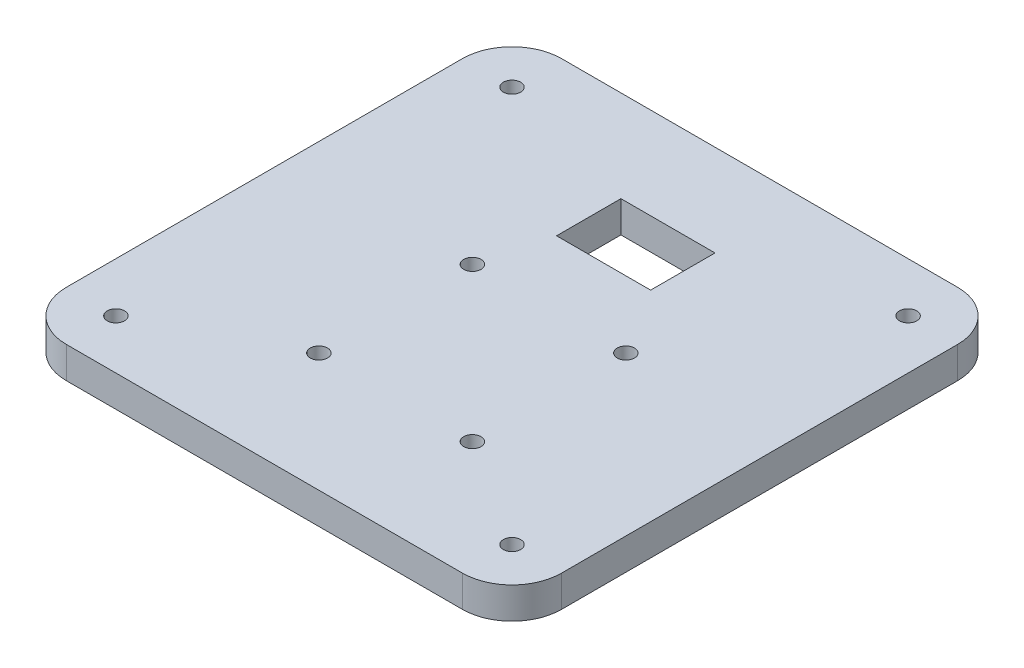
ISO-10303-21;
HEADER;
FILE_DESCRIPTION(('STEP AP214'),'2;1');
FILE_NAME('part.step','',(''),(''),'','','');
FILE_SCHEMA(('AUTOMOTIVE_DESIGN { 1 0 10303 214 1 1 1 1 }'));
ENDSEC;
DATA;
#1=APPLICATION_CONTEXT('core data for automotive mechanical design processes');
#2=APPLICATION_PROTOCOL_DEFINITION('international standard','automotive_design',2000,#1);
#3=PRODUCT_CONTEXT('',#1,'mechanical');
#4=PRODUCT('Part','Part','',(#3));
#5=PRODUCT_RELATED_PRODUCT_CATEGORY('part','',(#4));
#6=PRODUCT_DEFINITION_FORMATION('','',#4);
#7=PRODUCT_DEFINITION_CONTEXT('part definition',#1,'design');
#8=PRODUCT_DEFINITION('design','',#6,#7);
#9=PRODUCT_DEFINITION_SHAPE('','',#8);
#10=(LENGTH_UNIT() NAMED_UNIT(*) SI_UNIT(.MILLI.,.METRE.));
#11=(NAMED_UNIT(*) PLANE_ANGLE_UNIT() SI_UNIT($,.RADIAN.));
#12=(NAMED_UNIT(*) SI_UNIT($,.STERADIAN.) SOLID_ANGLE_UNIT());
#13=UNCERTAINTY_MEASURE_WITH_UNIT(LENGTH_MEASURE(1.E-05),#10,'distance_accuracy_value','');
#14=(GEOMETRIC_REPRESENTATION_CONTEXT(3) GLOBAL_UNCERTAINTY_ASSIGNED_CONTEXT((#13)) GLOBAL_UNIT_ASSIGNED_CONTEXT((#10,
#11,#12)) REPRESENTATION_CONTEXT('',''));
#15=CARTESIAN_POINT('',(0.,0.,0.));
#16=DIRECTION('',(0.,0.,1.));
#17=DIRECTION('',(1.,0.,0.));
#18=AXIS2_PLACEMENT_3D('',#15,#16,#17);
#19=CARTESIAN_POINT('',(-50.,6.35,-50.));
#20=DIRECTION('',(0.,0.,-1.));
#21=DIRECTION('',(-1.,0.,0.));
#22=AXIS2_PLACEMENT_3D('',#19,#20,#21);
#23=PLANE('',#22);
#24=DIRECTION('',(1.,0.,0.));
#25=VECTOR('',#24,1.);
#26=CARTESIAN_POINT('',(-50.,6.35,-50.));
#27=LINE('',#26,#25);
#28=CARTESIAN_POINT('',(-40.,6.35,-50.));
#29=VERTEX_POINT('',#28);
#30=CARTESIAN_POINT('',(40.,6.35,-50.));
#31=VERTEX_POINT('',#30);
#32=EDGE_CURVE('E220',#29,#31,#27,.T.);
#33=ORIENTED_EDGE('',*,*,#32,.T.);
#34=DIRECTION('',(0.,-1.,0.));
#35=VECTOR('',#34,1.);
#36=CARTESIAN_POINT('',(40.,6.35,-50.));
#37=LINE('',#36,#35);
#38=CARTESIAN_POINT('',(40.,0.,-50.));
#39=VERTEX_POINT('',#38);
#40=EDGE_CURVE('E11',#31,#39,#37,.T.);
#41=ORIENTED_EDGE('',*,*,#40,.T.);
#42=DIRECTION('',(1.,0.,0.));
#43=VECTOR('',#42,1.);
#44=CARTESIAN_POINT('',(-50.,0.,-50.));
#45=LINE('',#44,#43);
#46=CARTESIAN_POINT('',(-40.,0.,-50.));
#47=VERTEX_POINT('',#46);
#48=EDGE_CURVE('E217',#47,#39,#45,.T.);
#49=ORIENTED_EDGE('',*,*,#48,.F.);
#50=DIRECTION('',(0.,-1.,0.));
#51=VECTOR('',#50,1.);
#52=CARTESIAN_POINT('',(-40.,6.35,-50.));
#53=LINE('',#52,#51);
#54=EDGE_CURVE('E45',#47,#29,#53,.F.);
#55=ORIENTED_EDGE('',*,*,#54,.T.);
#56=EDGE_LOOP('',(#33,#41,#49,#55));
#57=FACE_BOUND('',#56,.T.);
#58=ADVANCED_FACE('F37',(#57),#23,.T.);
#59=CARTESIAN_POINT('',(-50.,6.35,-50.));
#60=DIRECTION('',(1.,0.,0.));
#61=DIRECTION('',(0.,0.,-1.));
#62=AXIS2_PLACEMENT_3D('',#59,#60,#61);
#63=PLANE('',#62);
#64=DIRECTION('',(0.,0.,1.));
#65=VECTOR('',#64,1.);
#66=CARTESIAN_POINT('',(-50.,0.,-50.));
#67=LINE('',#66,#65);
#68=CARTESIAN_POINT('',(-50.,0.,-40.));
#69=VERTEX_POINT('',#68);
#70=CARTESIAN_POINT('',(-50.,0.,40.));
#71=VERTEX_POINT('',#70);
#72=EDGE_CURVE('E224',#69,#71,#67,.T.);
#73=ORIENTED_EDGE('',*,*,#72,.T.);
#74=DIRECTION('',(0.,-1.,0.));
#75=VECTOR('',#74,1.);
#76=CARTESIAN_POINT('',(-50.,6.35,40.));
#77=LINE('',#76,#75);
#78=CARTESIAN_POINT('',(-50.,6.35,40.));
#79=VERTEX_POINT('',#78);
#80=EDGE_CURVE('E257',#71,#79,#77,.F.);
#81=ORIENTED_EDGE('',*,*,#80,.T.);
#82=DIRECTION('',(0.,0.,1.));
#83=VECTOR('',#82,1.);
#84=CARTESIAN_POINT('',(-50.,6.35,-50.));
#85=LINE('',#84,#83);
#86=CARTESIAN_POINT('',(-50.,6.35,-40.));
#87=VERTEX_POINT('',#86);
#88=EDGE_CURVE('E228',#87,#79,#85,.T.);
#89=ORIENTED_EDGE('',*,*,#88,.F.);
#90=DIRECTION('',(0.,-1.,0.));
#91=VECTOR('',#90,1.);
#92=CARTESIAN_POINT('',(-50.,0.,-40.));
#93=LINE('',#92,#91);
#94=EDGE_CURVE('E254',#87,#69,#93,.T.);
#95=ORIENTED_EDGE('',*,*,#94,.T.);
#96=EDGE_LOOP('',(#73,#81,#89,#95));
#97=FACE_BOUND('',#96,.T.);
#98=ADVANCED_FACE('F281',(#97),#63,.F.);
#99=CARTESIAN_POINT('',(-50.,6.35,50.));
#100=DIRECTION('',(0.,0.,-1.));
#101=DIRECTION('',(-1.,0.,0.));
#102=AXIS2_PLACEMENT_3D('',#99,#100,#101);
#103=PLANE('',#102);
#104=DIRECTION('',(1.,0.,0.));
#105=VECTOR('',#104,1.);
#106=CARTESIAN_POINT('',(-50.,6.35,50.));
#107=LINE('',#106,#105);
#108=CARTESIAN_POINT('',(-40.,6.35,50.));
#109=VERTEX_POINT('',#108);
#110=CARTESIAN_POINT('',(40.,6.35,50.));
#111=VERTEX_POINT('',#110);
#112=EDGE_CURVE('E226',#109,#111,#107,.T.);
#113=ORIENTED_EDGE('',*,*,#112,.F.);
#114=DIRECTION('',(0.,-1.,0.));
#115=VECTOR('',#114,1.);
#116=CARTESIAN_POINT('',(-40.,6.35,50.));
#117=LINE('',#116,#115);
#118=CARTESIAN_POINT('',(-40.,0.,50.));
#119=VERTEX_POINT('',#118);
#120=EDGE_CURVE('E243',#109,#119,#117,.T.);
#121=ORIENTED_EDGE('',*,*,#120,.T.);
#122=DIRECTION('',(1.,0.,0.));
#123=VECTOR('',#122,1.);
#124=CARTESIAN_POINT('',(-50.,0.,50.));
#125=LINE('',#124,#123);
#126=CARTESIAN_POINT('',(40.,0.,50.));
#127=VERTEX_POINT('',#126);
#128=EDGE_CURVE('E237',#119,#127,#125,.T.);
#129=ORIENTED_EDGE('',*,*,#128,.T.);
#130=DIRECTION('',(0.,-1.,0.));
#131=VECTOR('',#130,1.);
#132=CARTESIAN_POINT('',(40.,6.35,50.));
#133=LINE('',#132,#131);
#134=EDGE_CURVE('E231',#127,#111,#133,.F.);
#135=ORIENTED_EDGE('',*,*,#134,.T.);
#136=EDGE_LOOP('',(#113,#121,#129,#135));
#137=FACE_BOUND('',#136,.T.);
#138=ADVANCED_FACE('F292',(#137),#103,.F.);
#139=CARTESIAN_POINT('',(50.,6.35,-50.));
#140=DIRECTION('',(1.,0.,0.));
#141=DIRECTION('',(0.,0.,-1.));
#142=AXIS2_PLACEMENT_3D('',#139,#140,#141);
#143=PLANE('',#142);
#144=DIRECTION('',(0.,0.,1.));
#145=VECTOR('',#144,1.);
#146=CARTESIAN_POINT('',(50.,6.35,-50.));
#147=LINE('',#146,#145);
#148=CARTESIAN_POINT('',(50.,6.35,-40.));
#149=VERTEX_POINT('',#148);
#150=CARTESIAN_POINT('',(50.,6.35,40.));
#151=VERTEX_POINT('',#150);
#152=EDGE_CURVE('E223',#149,#151,#147,.T.);
#153=ORIENTED_EDGE('',*,*,#152,.T.);
#154=DIRECTION('',(0.,-1.,0.));
#155=VECTOR('',#154,1.);
#156=CARTESIAN_POINT('',(50.,0.,40.));
#157=LINE('',#156,#155);
#158=CARTESIAN_POINT('',(50.,0.,40.));
#159=VERTEX_POINT('',#158);
#160=EDGE_CURVE('E267',#151,#159,#157,.T.);
#161=ORIENTED_EDGE('',*,*,#160,.T.);
#162=DIRECTION('',(0.,0.,1.));
#163=VECTOR('',#162,1.);
#164=CARTESIAN_POINT('',(50.,0.,-50.));
#165=LINE('',#164,#163);
#166=CARTESIAN_POINT('',(50.,0.,-40.));
#167=VERTEX_POINT('',#166);
#168=EDGE_CURVE('E234',#167,#159,#165,.T.);
#169=ORIENTED_EDGE('',*,*,#168,.F.);
#170=DIRECTION('',(0.,-1.,0.));
#171=VECTOR('',#170,1.);
#172=CARTESIAN_POINT('',(50.,6.35,-40.));
#173=LINE('',#172,#171);
#174=EDGE_CURVE('E59',#167,#149,#173,.F.);
#175=ORIENTED_EDGE('',*,*,#174,.T.);
#176=EDGE_LOOP('',(#153,#161,#169,#175));
#177=FACE_BOUND('',#176,.T.);
#178=ADVANCED_FACE('F297',(#177),#143,.T.);
#179=CARTESIAN_POINT('',(0.,6.35,0.));
#180=DIRECTION('',(0.,-1.,0.));
#181=DIRECTION('',(0.,0.,-1.));
#182=AXIS2_PLACEMENT_3D('',#179,#180,#181);
#183=PLANE('',#182);
#184=DIRECTION('',(1.,0.,0.));
#185=VECTOR('',#184,1.);
#186=CARTESIAN_POINT('',(-9.49999999999999,6.35,-31.5));
#187=LINE('',#186,#185);
#188=CARTESIAN_POINT('',(-9.49999999999999,6.35,-31.5));
#189=VERTEX_POINT('',#188);
#190=CARTESIAN_POINT('',(9.50000000000001,6.35,-31.5));
#191=VERTEX_POINT('',#190);
#192=EDGE_CURVE('E140',#189,#191,#187,.T.);
#193=ORIENTED_EDGE('',*,*,#192,.T.);
#194=DIRECTION('',(0.,0.,1.));
#195=VECTOR('',#194,1.);
#196=CARTESIAN_POINT('',(9.50000000000001,6.35,-31.5));
#197=LINE('',#196,#195);
#198=CARTESIAN_POINT('',(9.50000000000001,6.35,-18.5));
#199=VERTEX_POINT('',#198);
#200=EDGE_CURVE('E132',#191,#199,#197,.T.);
#201=ORIENTED_EDGE('',*,*,#200,.T.);
#202=DIRECTION('',(-1.,0.,0.));
#203=VECTOR('',#202,1.);
#204=CARTESIAN_POINT('',(-9.49999999999999,6.35,-18.5));
#205=LINE('',#204,#203);
#206=CARTESIAN_POINT('',(-9.49999999999999,6.35,-18.5));
#207=VERTEX_POINT('',#206);
#208=EDGE_CURVE('E144',#199,#207,#205,.T.);
#209=ORIENTED_EDGE('',*,*,#208,.T.);
#210=DIRECTION('',(0.,0.,-1.));
#211=VECTOR('',#210,1.);
#212=CARTESIAN_POINT('',(-9.49999999999999,6.35,-31.5));
#213=LINE('',#212,#211);
#214=EDGE_CURVE('E148',#207,#189,#213,.T.);
#215=ORIENTED_EDGE('',*,*,#214,.T.);
#216=EDGE_LOOP('',(#193,#201,#209,#215));
#217=FACE_BOUND('',#216,.T.);
#218=CARTESIAN_POINT('',(-13.,6.35,26.));
#219=DIRECTION('',(0.,-1.,0.));
#220=DIRECTION('',(0.,0.,-1.));
#221=AXIS2_PLACEMENT_3D('',#218,#219,#220);
#222=CIRCLE('',#221,1.75);
#223=CARTESIAN_POINT('',(-13.,6.35,24.25));
#224=VERTEX_POINT('',#223);
#225=EDGE_CURVE('E172',#224,#224,#222,.T.);
#226=ORIENTED_EDGE('',*,*,#225,.T.);
#227=EDGE_LOOP('',(#226));
#228=FACE_BOUND('',#227,.T.);
#229=CARTESIAN_POINT('',(-13.,6.35,-5.));
#230=DIRECTION('',(0.,-1.,0.));
#231=DIRECTION('',(0.,0.,-1.));
#232=AXIS2_PLACEMENT_3D('',#229,#230,#231);
#233=CIRCLE('',#232,1.75);
#234=CARTESIAN_POINT('',(-13.,6.35,-6.75));
#235=VERTEX_POINT('',#234);
#236=EDGE_CURVE('E178',#235,#235,#233,.T.);
#237=ORIENTED_EDGE('',*,*,#236,.T.);
#238=EDGE_LOOP('',(#237));
#239=FACE_BOUND('',#238,.T.);
#240=CARTESIAN_POINT('',(18.,6.35,26.));
#241=DIRECTION('',(0.,-1.,0.));
#242=DIRECTION('',(0.,0.,-1.));
#243=AXIS2_PLACEMENT_3D('',#240,#241,#242);
#244=CIRCLE('',#243,1.75);
#245=CARTESIAN_POINT('',(18.,6.35,24.25));
#246=VERTEX_POINT('',#245);
#247=EDGE_CURVE('E184',#246,#246,#244,.T.);
#248=ORIENTED_EDGE('',*,*,#247,.T.);
#249=EDGE_LOOP('',(#248));
#250=FACE_BOUND('',#249,.T.);
#251=CARTESIAN_POINT('',(18.,6.35,-5.));
#252=DIRECTION('',(0.,-1.,0.));
#253=DIRECTION('',(0.,0.,-1.));
#254=AXIS2_PLACEMENT_3D('',#251,#252,#253);
#255=CIRCLE('',#254,1.75);
#256=CARTESIAN_POINT('',(18.,6.35,-6.75));
#257=VERTEX_POINT('',#256);
#258=EDGE_CURVE('E190',#257,#257,#255,.T.);
#259=ORIENTED_EDGE('',*,*,#258,.T.);
#260=EDGE_LOOP('',(#259));
#261=FACE_BOUND('',#260,.T.);
#262=CARTESIAN_POINT('',(40.,6.35,40.));
#263=DIRECTION('',(0.,-1.,0.));
#264=DIRECTION('',(0.,0.,-1.));
#265=AXIS2_PLACEMENT_3D('',#262,#263,#264);
#266=CIRCLE('',#265,1.75);
#267=CARTESIAN_POINT('',(40.,6.35,38.25));
#268=VERTEX_POINT('',#267);
#269=EDGE_CURVE('E196',#268,#268,#266,.T.);
#270=ORIENTED_EDGE('',*,*,#269,.T.);
#271=EDGE_LOOP('',(#270));
#272=FACE_BOUND('',#271,.T.);
#273=CARTESIAN_POINT('',(40.,6.35,-40.));
#274=DIRECTION('',(0.,-1.,0.));
#275=DIRECTION('',(0.,0.,-1.));
#276=AXIS2_PLACEMENT_3D('',#273,#274,#275);
#277=CIRCLE('',#276,1.75);
#278=CARTESIAN_POINT('',(40.,6.35,-41.75));
#279=VERTEX_POINT('',#278);
#280=EDGE_CURVE('E202',#279,#279,#277,.T.);
#281=ORIENTED_EDGE('',*,*,#280,.T.);
#282=EDGE_LOOP('',(#281));
#283=FACE_BOUND('',#282,.T.);
#284=CARTESIAN_POINT('',(-40.,6.35,40.));
#285=DIRECTION('',(0.,-1.,0.));
#286=DIRECTION('',(0.,0.,-1.));
#287=AXIS2_PLACEMENT_3D('',#284,#285,#286);
#288=CIRCLE('',#287,1.75);
#289=CARTESIAN_POINT('',(-40.,6.35,38.25));
#290=VERTEX_POINT('',#289);
#291=EDGE_CURVE('E208',#290,#290,#288,.T.);
#292=ORIENTED_EDGE('',*,*,#291,.T.);
#293=EDGE_LOOP('',(#292));
#294=FACE_BOUND('',#293,.T.);
#295=CARTESIAN_POINT('',(-40.,6.35,-40.));
#296=DIRECTION('',(0.,-1.,0.));
#297=DIRECTION('',(0.,0.,-1.));
#298=AXIS2_PLACEMENT_3D('',#295,#296,#297);
#299=CIRCLE('',#298,1.75);
#300=CARTESIAN_POINT('',(-40.,6.35,-41.75));
#301=VERTEX_POINT('',#300);
#302=EDGE_CURVE('E214',#301,#301,#299,.T.);
#303=ORIENTED_EDGE('',*,*,#302,.T.);
#304=EDGE_LOOP('',(#303));
#305=FACE_BOUND('',#304,.T.);
#306=ORIENTED_EDGE('',*,*,#88,.T.);
#307=CARTESIAN_POINT('',(-40.,6.35,40.));
#308=DIRECTION('',(0.,-1.,0.));
#309=DIRECTION('',(0.,0.,-1.));
#310=AXIS2_PLACEMENT_3D('',#307,#308,#309);
#311=CIRCLE('',#310,10.);
#312=EDGE_CURVE('E264',#79,#109,#311,.F.);
#313=ORIENTED_EDGE('',*,*,#312,.T.);
#314=ORIENTED_EDGE('',*,*,#112,.T.);
#315=CARTESIAN_POINT('',(40.,6.35,40.));
#316=DIRECTION('',(0.,-1.,0.));
#317=DIRECTION('',(0.,0.,-1.));
#318=AXIS2_PLACEMENT_3D('',#315,#316,#317);
#319=CIRCLE('',#318,10.);
#320=EDGE_CURVE('E52',#111,#151,#319,.F.);
#321=ORIENTED_EDGE('',*,*,#320,.T.);
#322=ORIENTED_EDGE('',*,*,#152,.F.);
#323=CARTESIAN_POINT('',(40.,6.35,-40.));
#324=DIRECTION('',(0.,-1.,0.));
#325=DIRECTION('',(0.,0.,-1.));
#326=AXIS2_PLACEMENT_3D('',#323,#324,#325);
#327=CIRCLE('',#326,10.);
#328=EDGE_CURVE('E261',#149,#31,#327,.F.);
#329=ORIENTED_EDGE('',*,*,#328,.T.);
#330=ORIENTED_EDGE('',*,*,#32,.F.);
#331=CARTESIAN_POINT('',(-40.,6.35,-40.));
#332=DIRECTION('',(0.,-1.,0.));
#333=DIRECTION('',(0.,0.,-1.));
#334=AXIS2_PLACEMENT_3D('',#331,#332,#333);
#335=CIRCLE('',#334,10.);
#336=EDGE_CURVE('E259',#29,#87,#335,.F.);
#337=ORIENTED_EDGE('',*,*,#336,.T.);
#338=EDGE_LOOP('',(#306,#313,#314,#321,#322,#329,#330,#337));
#339=FACE_BOUND('',#338,.T.);
#340=ADVANCED_FACE('F150',(#217,#228,#239,#250,#261,#272,#283,#294,#305,#339),#183,.F.);
#341=CARTESIAN_POINT('',(0.,0.,0.));
#342=DIRECTION('',(0.,-1.,0.));
#343=DIRECTION('',(0.,0.,-1.));
#344=AXIS2_PLACEMENT_3D('',#341,#342,#343);
#345=PLANE('',#344);
#346=DIRECTION('',(0.,0.,1.));
#347=VECTOR('',#346,1.);
#348=CARTESIAN_POINT('',(9.50000000000001,0.,-31.5));
#349=LINE('',#348,#347);
#350=CARTESIAN_POINT('',(9.50000000000001,0.,-31.5));
#351=VERTEX_POINT('',#350);
#352=CARTESIAN_POINT('',(9.50000000000001,0.,-18.5));
#353=VERTEX_POINT('',#352);
#354=EDGE_CURVE('E135',#351,#353,#349,.T.);
#355=ORIENTED_EDGE('',*,*,#354,.F.);
#356=DIRECTION('',(1.,0.,0.));
#357=VECTOR('',#356,1.);
#358=CARTESIAN_POINT('',(-9.49999999999999,0.,-31.5));
#359=LINE('',#358,#357);
#360=CARTESIAN_POINT('',(-9.49999999999999,0.,-31.5));
#361=VERTEX_POINT('',#360);
#362=EDGE_CURVE('E153',#361,#351,#359,.T.);
#363=ORIENTED_EDGE('',*,*,#362,.F.);
#364=DIRECTION('',(0.,0.,-1.));
#365=VECTOR('',#364,1.);
#366=CARTESIAN_POINT('',(-9.49999999999999,0.,-31.5));
#367=LINE('',#366,#365);
#368=CARTESIAN_POINT('',(-9.49999999999999,0.,-18.5));
#369=VERTEX_POINT('',#368);
#370=EDGE_CURVE('E156',#369,#361,#367,.T.);
#371=ORIENTED_EDGE('',*,*,#370,.F.);
#372=DIRECTION('',(-1.,0.,0.));
#373=VECTOR('',#372,1.);
#374=CARTESIAN_POINT('',(-9.49999999999999,0.,-18.5));
#375=LINE('',#374,#373);
#376=EDGE_CURVE('E162',#353,#369,#375,.T.);
#377=ORIENTED_EDGE('',*,*,#376,.F.);
#378=EDGE_LOOP('',(#355,#363,#371,#377));
#379=FACE_BOUND('',#378,.T.);
#380=CARTESIAN_POINT('',(-13.,0.,26.));
#381=DIRECTION('',(0.,-1.,0.));
#382=DIRECTION('',(0.,0.,-1.));
#383=AXIS2_PLACEMENT_3D('',#380,#381,#382);
#384=CIRCLE('',#383,1.75);
#385=CARTESIAN_POINT('',(-13.,0.,24.25));
#386=VERTEX_POINT('',#385);
#387=EDGE_CURVE('E168',#386,#386,#384,.T.);
#388=ORIENTED_EDGE('',*,*,#387,.F.);
#389=EDGE_LOOP('',(#388));
#390=FACE_BOUND('',#389,.T.);
#391=CARTESIAN_POINT('',(-13.,0.,-5.));
#392=DIRECTION('',(0.,-1.,0.));
#393=DIRECTION('',(0.,0.,-1.));
#394=AXIS2_PLACEMENT_3D('',#391,#392,#393);
#395=CIRCLE('',#394,1.75);
#396=CARTESIAN_POINT('',(-13.,0.,-6.75));
#397=VERTEX_POINT('',#396);
#398=EDGE_CURVE('E175',#397,#397,#395,.T.);
#399=ORIENTED_EDGE('',*,*,#398,.F.);
#400=EDGE_LOOP('',(#399));
#401=FACE_BOUND('',#400,.T.);
#402=CARTESIAN_POINT('',(18.,0.,26.));
#403=DIRECTION('',(0.,-1.,0.));
#404=DIRECTION('',(0.,0.,-1.));
#405=AXIS2_PLACEMENT_3D('',#402,#403,#404);
#406=CIRCLE('',#405,1.75);
#407=CARTESIAN_POINT('',(18.,0.,24.25));
#408=VERTEX_POINT('',#407);
#409=EDGE_CURVE('E181',#408,#408,#406,.T.);
#410=ORIENTED_EDGE('',*,*,#409,.F.);
#411=EDGE_LOOP('',(#410));
#412=FACE_BOUND('',#411,.T.);
#413=CARTESIAN_POINT('',(18.,0.,-5.));
#414=DIRECTION('',(0.,-1.,0.));
#415=DIRECTION('',(0.,0.,-1.));
#416=AXIS2_PLACEMENT_3D('',#413,#414,#415);
#417=CIRCLE('',#416,1.75);
#418=CARTESIAN_POINT('',(18.,0.,-6.75));
#419=VERTEX_POINT('',#418);
#420=EDGE_CURVE('E187',#419,#419,#417,.T.);
#421=ORIENTED_EDGE('',*,*,#420,.F.);
#422=EDGE_LOOP('',(#421));
#423=FACE_BOUND('',#422,.T.);
#424=CARTESIAN_POINT('',(40.,0.,40.));
#425=DIRECTION('',(0.,-1.,0.));
#426=DIRECTION('',(0.,0.,-1.));
#427=AXIS2_PLACEMENT_3D('',#424,#425,#426);
#428=CIRCLE('',#427,1.75);
#429=CARTESIAN_POINT('',(40.,0.,38.25));
#430=VERTEX_POINT('',#429);
#431=EDGE_CURVE('E193',#430,#430,#428,.T.);
#432=ORIENTED_EDGE('',*,*,#431,.F.);
#433=EDGE_LOOP('',(#432));
#434=FACE_BOUND('',#433,.T.);
#435=CARTESIAN_POINT('',(40.,0.,-40.));
#436=DIRECTION('',(0.,-1.,0.));
#437=DIRECTION('',(0.,0.,-1.));
#438=AXIS2_PLACEMENT_3D('',#435,#436,#437);
#439=CIRCLE('',#438,1.75);
#440=CARTESIAN_POINT('',(40.,0.,-41.75));
#441=VERTEX_POINT('',#440);
#442=EDGE_CURVE('E199',#441,#441,#439,.T.);
#443=ORIENTED_EDGE('',*,*,#442,.F.);
#444=EDGE_LOOP('',(#443));
#445=FACE_BOUND('',#444,.T.);
#446=CARTESIAN_POINT('',(-40.,0.,40.));
#447=DIRECTION('',(0.,-1.,0.));
#448=DIRECTION('',(0.,0.,-1.));
#449=AXIS2_PLACEMENT_3D('',#446,#447,#448);
#450=CIRCLE('',#449,1.75);
#451=CARTESIAN_POINT('',(-40.,0.,38.25));
#452=VERTEX_POINT('',#451);
#453=EDGE_CURVE('E205',#452,#452,#450,.T.);
#454=ORIENTED_EDGE('',*,*,#453,.F.);
#455=EDGE_LOOP('',(#454));
#456=FACE_BOUND('',#455,.T.);
#457=CARTESIAN_POINT('',(-40.,0.,-40.));
#458=DIRECTION('',(0.,-1.,0.));
#459=DIRECTION('',(0.,0.,-1.));
#460=AXIS2_PLACEMENT_3D('',#457,#458,#459);
#461=CIRCLE('',#460,1.75);
#462=CARTESIAN_POINT('',(-40.,0.,-41.75));
#463=VERTEX_POINT('',#462);
#464=EDGE_CURVE('E211',#463,#463,#461,.T.);
#465=ORIENTED_EDGE('',*,*,#464,.F.);
#466=EDGE_LOOP('',(#465));
#467=FACE_BOUND('',#466,.T.);
#468=ORIENTED_EDGE('',*,*,#128,.F.);
#469=CARTESIAN_POINT('',(-40.,0.,40.));
#470=DIRECTION('',(0.,-1.,0.));
#471=DIRECTION('',(0.,0.,-1.));
#472=AXIS2_PLACEMENT_3D('',#469,#470,#471);
#473=CIRCLE('',#472,10.);
#474=EDGE_CURVE('E252',#119,#71,#473,.T.);
#475=ORIENTED_EDGE('',*,*,#474,.T.);
#476=ORIENTED_EDGE('',*,*,#72,.F.);
#477=CARTESIAN_POINT('',(-40.,0.,-40.));
#478=DIRECTION('',(0.,-1.,0.));
#479=DIRECTION('',(0.,0.,-1.));
#480=AXIS2_PLACEMENT_3D('',#477,#478,#479);
#481=CIRCLE('',#480,10.);
#482=EDGE_CURVE('E246',#69,#47,#481,.T.);
#483=ORIENTED_EDGE('',*,*,#482,.T.);
#484=ORIENTED_EDGE('',*,*,#48,.T.);
#485=CARTESIAN_POINT('',(40.,0.,-40.));
#486=DIRECTION('',(0.,-1.,0.));
#487=DIRECTION('',(0.,0.,-1.));
#488=AXIS2_PLACEMENT_3D('',#485,#486,#487);
#489=CIRCLE('',#488,10.);
#490=EDGE_CURVE('E248',#39,#167,#489,.T.);
#491=ORIENTED_EDGE('',*,*,#490,.T.);
#492=ORIENTED_EDGE('',*,*,#168,.T.);
#493=CARTESIAN_POINT('',(40.,0.,40.));
#494=DIRECTION('',(0.,-1.,0.));
#495=DIRECTION('',(0.,0.,-1.));
#496=AXIS2_PLACEMENT_3D('',#493,#494,#495);
#497=CIRCLE('',#496,10.);
#498=EDGE_CURVE('E250',#159,#127,#497,.T.);
#499=ORIENTED_EDGE('',*,*,#498,.T.);
#500=EDGE_LOOP('',(#468,#475,#476,#483,#484,#491,#492,#499));
#501=FACE_BOUND('',#500,.T.);
#502=ADVANCED_FACE('F285',(#379,#390,#401,#412,#423,#434,#445,#456,#467,#501),#345,.T.);
#503=CARTESIAN_POINT('',(-40.,6.35,-40.));
#504=DIRECTION('',(0.,-1.,0.));
#505=DIRECTION('',(0.,0.,-1.));
#506=AXIS2_PLACEMENT_3D('',#503,#504,#505);
#507=CYLINDRICAL_SURFACE('',#506,1.75);
#508=ORIENTED_EDGE('',*,*,#302,.F.);
#509=EDGE_LOOP('',(#508));
#510=FACE_BOUND('',#509,.T.);
#511=ORIENTED_EDGE('',*,*,#464,.T.);
#512=EDGE_LOOP('',(#511));
#513=FACE_BOUND('',#512,.T.);
#514=ADVANCED_FACE('F358',(#510,#513),#507,.F.);
#515=CARTESIAN_POINT('',(-40.,6.35,40.));
#516=DIRECTION('',(0.,-1.,0.));
#517=DIRECTION('',(0.,0.,-1.));
#518=AXIS2_PLACEMENT_3D('',#515,#516,#517);
#519=CYLINDRICAL_SURFACE('',#518,1.75);
#520=ORIENTED_EDGE('',*,*,#291,.F.);
#521=EDGE_LOOP('',(#520));
#522=FACE_BOUND('',#521,.T.);
#523=ORIENTED_EDGE('',*,*,#453,.T.);
#524=EDGE_LOOP('',(#523));
#525=FACE_BOUND('',#524,.T.);
#526=ADVANCED_FACE('F354',(#522,#525),#519,.F.);
#527=CARTESIAN_POINT('',(40.,6.35,-40.));
#528=DIRECTION('',(0.,-1.,0.));
#529=DIRECTION('',(0.,0.,-1.));
#530=AXIS2_PLACEMENT_3D('',#527,#528,#529);
#531=CYLINDRICAL_SURFACE('',#530,1.75);
#532=ORIENTED_EDGE('',*,*,#280,.F.);
#533=EDGE_LOOP('',(#532));
#534=FACE_BOUND('',#533,.T.);
#535=ORIENTED_EDGE('',*,*,#442,.T.);
#536=EDGE_LOOP('',(#535));
#537=FACE_BOUND('',#536,.T.);
#538=ADVANCED_FACE('F350',(#534,#537),#531,.F.);
#539=CARTESIAN_POINT('',(40.,6.35,40.));
#540=DIRECTION('',(0.,-1.,0.));
#541=DIRECTION('',(0.,0.,-1.));
#542=AXIS2_PLACEMENT_3D('',#539,#540,#541);
#543=CYLINDRICAL_SURFACE('',#542,1.75);
#544=ORIENTED_EDGE('',*,*,#269,.F.);
#545=EDGE_LOOP('',(#544));
#546=FACE_BOUND('',#545,.T.);
#547=ORIENTED_EDGE('',*,*,#431,.T.);
#548=EDGE_LOOP('',(#547));
#549=FACE_BOUND('',#548,.T.);
#550=ADVANCED_FACE('F346',(#546,#549),#543,.F.);
#551=CARTESIAN_POINT('',(18.,6.35,-5.));
#552=DIRECTION('',(0.,-1.,0.));
#553=DIRECTION('',(0.,0.,-1.));
#554=AXIS2_PLACEMENT_3D('',#551,#552,#553);
#555=CYLINDRICAL_SURFACE('',#554,1.75);
#556=ORIENTED_EDGE('',*,*,#258,.F.);
#557=EDGE_LOOP('',(#556));
#558=FACE_BOUND('',#557,.T.);
#559=ORIENTED_EDGE('',*,*,#420,.T.);
#560=EDGE_LOOP('',(#559));
#561=FACE_BOUND('',#560,.T.);
#562=ADVANCED_FACE('F342',(#558,#561),#555,.F.);
#563=CARTESIAN_POINT('',(18.,6.35,26.));
#564=DIRECTION('',(0.,-1.,0.));
#565=DIRECTION('',(0.,0.,-1.));
#566=AXIS2_PLACEMENT_3D('',#563,#564,#565);
#567=CYLINDRICAL_SURFACE('',#566,1.75);
#568=ORIENTED_EDGE('',*,*,#247,.F.);
#569=EDGE_LOOP('',(#568));
#570=FACE_BOUND('',#569,.T.);
#571=ORIENTED_EDGE('',*,*,#409,.T.);
#572=EDGE_LOOP('',(#571));
#573=FACE_BOUND('',#572,.T.);
#574=ADVANCED_FACE('F338',(#570,#573),#567,.F.);
#575=CARTESIAN_POINT('',(-13.,6.35,-5.));
#576=DIRECTION('',(0.,-1.,0.));
#577=DIRECTION('',(0.,0.,-1.));
#578=AXIS2_PLACEMENT_3D('',#575,#576,#577);
#579=CYLINDRICAL_SURFACE('',#578,1.75);
#580=ORIENTED_EDGE('',*,*,#236,.F.);
#581=EDGE_LOOP('',(#580));
#582=FACE_BOUND('',#581,.T.);
#583=ORIENTED_EDGE('',*,*,#398,.T.);
#584=EDGE_LOOP('',(#583));
#585=FACE_BOUND('',#584,.T.);
#586=ADVANCED_FACE('F334',(#582,#585),#579,.F.);
#587=CARTESIAN_POINT('',(-13.,6.35,26.));
#588=DIRECTION('',(0.,-1.,0.));
#589=DIRECTION('',(0.,0.,-1.));
#590=AXIS2_PLACEMENT_3D('',#587,#588,#589);
#591=CYLINDRICAL_SURFACE('',#590,1.75);
#592=ORIENTED_EDGE('',*,*,#225,.F.);
#593=EDGE_LOOP('',(#592));
#594=FACE_BOUND('',#593,.T.);
#595=ORIENTED_EDGE('',*,*,#387,.T.);
#596=EDGE_LOOP('',(#595));
#597=FACE_BOUND('',#596,.T.);
#598=ADVANCED_FACE('F331',(#594,#597),#591,.F.);
#599=CARTESIAN_POINT('',(9.50000000000001,6.35,-31.5));
#600=DIRECTION('',(1.,0.,0.));
#601=DIRECTION('',(0.,0.,-1.));
#602=AXIS2_PLACEMENT_3D('',#599,#600,#601);
#603=PLANE('',#602);
#604=ORIENTED_EDGE('',*,*,#354,.T.);
#605=DIRECTION('',(0.,-1.,0.));
#606=VECTOR('',#605,1.);
#607=CARTESIAN_POINT('',(9.50000000000001,6.35,-18.5));
#608=LINE('',#607,#606);
#609=EDGE_CURVE('E128',#199,#353,#608,.T.);
#610=ORIENTED_EDGE('',*,*,#609,.F.);
#611=ORIENTED_EDGE('',*,*,#200,.F.);
#612=DIRECTION('',(0.,-1.,0.));
#613=VECTOR('',#612,1.);
#614=CARTESIAN_POINT('',(9.50000000000001,6.35,-31.5));
#615=LINE('',#614,#613);
#616=EDGE_CURVE('E166',#191,#351,#615,.T.);
#617=ORIENTED_EDGE('',*,*,#616,.T.);
#618=EDGE_LOOP('',(#604,#610,#611,#617));
#619=FACE_BOUND('',#618,.T.);
#620=ADVANCED_FACE('F130',(#619),#603,.F.);
#621=CARTESIAN_POINT('',(-9.49999999999999,6.35,-31.5));
#622=DIRECTION('',(0.,0.,-1.));
#623=DIRECTION('',(-1.,0.,0.));
#624=AXIS2_PLACEMENT_3D('',#621,#622,#623);
#625=PLANE('',#624);
#626=ORIENTED_EDGE('',*,*,#362,.T.);
#627=ORIENTED_EDGE('',*,*,#616,.F.);
#628=ORIENTED_EDGE('',*,*,#192,.F.);
#629=DIRECTION('',(0.,-1.,0.));
#630=VECTOR('',#629,1.);
#631=CARTESIAN_POINT('',(-9.49999999999999,6.35,-31.5));
#632=LINE('',#631,#630);
#633=EDGE_CURVE('E169',#189,#361,#632,.T.);
#634=ORIENTED_EDGE('',*,*,#633,.T.);
#635=EDGE_LOOP('',(#626,#627,#628,#634));
#636=FACE_BOUND('',#635,.T.);
#637=ADVANCED_FACE('F324',(#636),#625,.F.);
#638=CARTESIAN_POINT('',(-9.49999999999999,6.35,-31.5));
#639=DIRECTION('',(-1.,0.,0.));
#640=DIRECTION('',(0.,0.,1.));
#641=AXIS2_PLACEMENT_3D('',#638,#639,#640);
#642=PLANE('',#641);
#643=ORIENTED_EDGE('',*,*,#370,.T.);
#644=ORIENTED_EDGE('',*,*,#633,.F.);
#645=ORIENTED_EDGE('',*,*,#214,.F.);
#646=DIRECTION('',(0.,-1.,0.));
#647=VECTOR('',#646,1.);
#648=CARTESIAN_POINT('',(-9.49999999999999,6.35,-18.5));
#649=LINE('',#648,#647);
#650=EDGE_CURVE('E139',#207,#369,#649,.T.);
#651=ORIENTED_EDGE('',*,*,#650,.T.);
#652=EDGE_LOOP('',(#643,#644,#645,#651));
#653=FACE_BOUND('',#652,.T.);
#654=ADVANCED_FACE('F319',(#653),#642,.F.);
#655=CARTESIAN_POINT('',(-9.49999999999999,6.35,-18.5));
#656=DIRECTION('',(0.,0.,1.));
#657=DIRECTION('',(1.,0.,0.));
#658=AXIS2_PLACEMENT_3D('',#655,#656,#657);
#659=PLANE('',#658);
#660=ORIENTED_EDGE('',*,*,#376,.T.);
#661=ORIENTED_EDGE('',*,*,#650,.F.);
#662=ORIENTED_EDGE('',*,*,#208,.F.);
#663=ORIENTED_EDGE('',*,*,#609,.T.);
#664=EDGE_LOOP('',(#660,#661,#662,#663));
#665=FACE_BOUND('',#664,.T.);
#666=ADVANCED_FACE('F145',(#665),#659,.F.);
#667=CARTESIAN_POINT('',(-40.,6.35,40.));
#668=DIRECTION('',(0.,-1.,0.));
#669=DIRECTION('',(0.,0.,-1.));
#670=AXIS2_PLACEMENT_3D('',#667,#668,#669);
#671=CYLINDRICAL_SURFACE('',#670,10.);
#672=ORIENTED_EDGE('',*,*,#312,.F.);
#673=ORIENTED_EDGE('',*,*,#80,.F.);
#674=ORIENTED_EDGE('',*,*,#474,.F.);
#675=ORIENTED_EDGE('',*,*,#120,.F.);
#676=EDGE_LOOP('',(#672,#673,#674,#675));
#677=FACE_BOUND('',#676,.T.);
#678=ADVANCED_FACE('F289',(#677),#671,.T.);
#679=CARTESIAN_POINT('',(40.,6.35,40.));
#680=DIRECTION('',(0.,1.,0.));
#681=DIRECTION('',(0.,0.,1.));
#682=AXIS2_PLACEMENT_3D('',#679,#680,#681);
#683=CYLINDRICAL_SURFACE('',#682,10.);
#684=ORIENTED_EDGE('',*,*,#320,.F.);
#685=ORIENTED_EDGE('',*,*,#134,.F.);
#686=ORIENTED_EDGE('',*,*,#498,.F.);
#687=ORIENTED_EDGE('',*,*,#160,.F.);
#688=EDGE_LOOP('',(#684,#685,#686,#687));
#689=FACE_BOUND('',#688,.T.);
#690=ADVANCED_FACE('F296',(#689),#683,.T.);
#691=CARTESIAN_POINT('',(40.,6.35,-40.));
#692=DIRECTION('',(0.,-1.,0.));
#693=DIRECTION('',(0.,0.,-1.));
#694=AXIS2_PLACEMENT_3D('',#691,#692,#693);
#695=CYLINDRICAL_SURFACE('',#694,10.);
#696=ORIENTED_EDGE('',*,*,#328,.F.);
#697=ORIENTED_EDGE('',*,*,#174,.F.);
#698=ORIENTED_EDGE('',*,*,#490,.F.);
#699=ORIENTED_EDGE('',*,*,#40,.F.);
#700=EDGE_LOOP('',(#696,#697,#698,#699));
#701=FACE_BOUND('',#700,.T.);
#702=ADVANCED_FACE('F299',(#701),#695,.T.);
#703=CARTESIAN_POINT('',(-40.,6.35,-40.));
#704=DIRECTION('',(0.,1.,0.));
#705=DIRECTION('',(0.,0.,1.));
#706=AXIS2_PLACEMENT_3D('',#703,#704,#705);
#707=CYLINDRICAL_SURFACE('',#706,10.);
#708=ORIENTED_EDGE('',*,*,#336,.F.);
#709=ORIENTED_EDGE('',*,*,#54,.F.);
#710=ORIENTED_EDGE('',*,*,#482,.F.);
#711=ORIENTED_EDGE('',*,*,#94,.F.);
#712=EDGE_LOOP('',(#708,#709,#710,#711));
#713=FACE_BOUND('',#712,.T.);
#714=ADVANCED_FACE('F39',(#713),#707,.T.);
#715=CLOSED_SHELL('',(#58,#98,#138,#178,#340,#502,#514,#526,#538,#550,#562,#574,#586,#598,#620,
#637,#654,#666,#678,#690,#702,#714));
#716=MANIFOLD_SOLID_BREP('B2',#715);
#717=ADVANCED_BREP_SHAPE_REPRESENTATION('',(#18,#716),#14);
#718=SHAPE_DEFINITION_REPRESENTATION(#9,#717);
ENDSEC;
END-ISO-10303-21;
